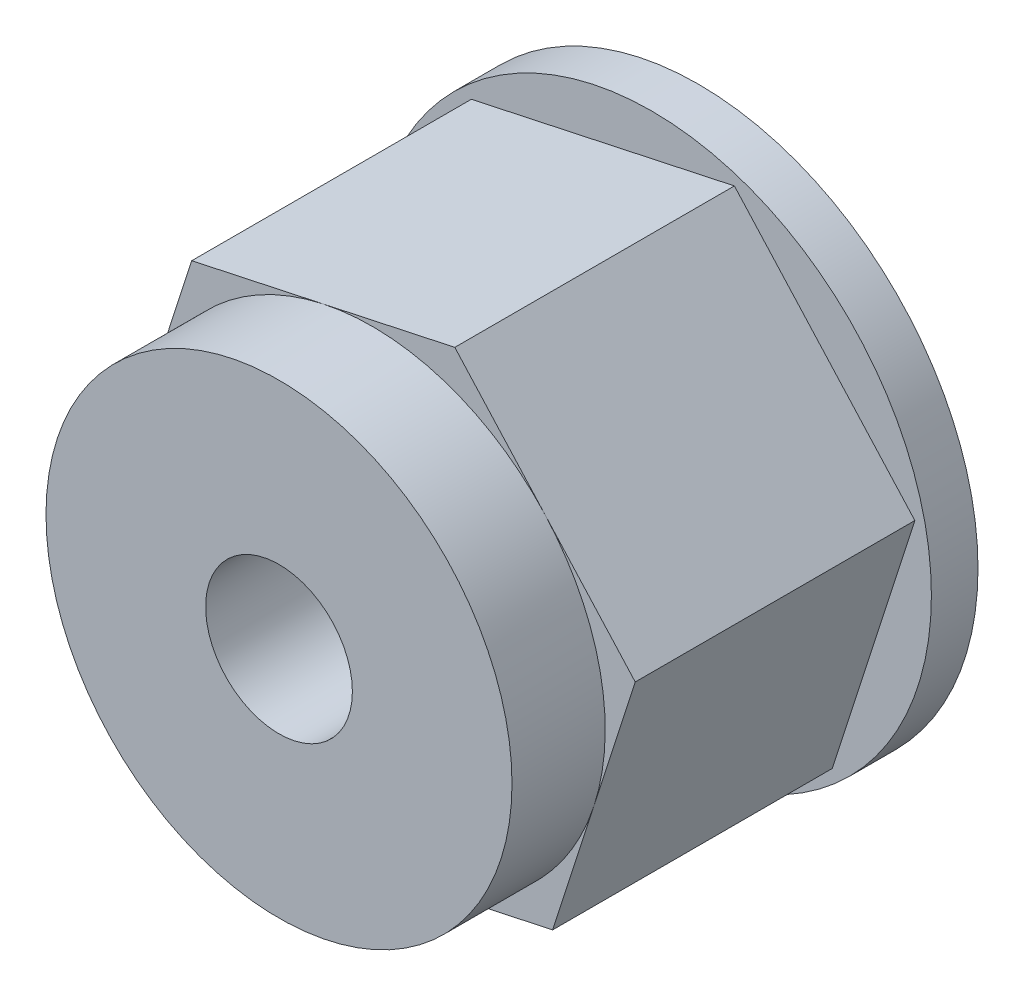
ISO-10303-21;
HEADER;
FILE_DESCRIPTION(('STEP AP214'),'2;1');
FILE_NAME('part.step','',(''),(''),'','','');
FILE_SCHEMA(('AUTOMOTIVE_DESIGN { 1 0 10303 214 1 1 1 1 }'));
ENDSEC;
DATA;
#1=APPLICATION_CONTEXT('core data for automotive mechanical design processes');
#2=APPLICATION_PROTOCOL_DEFINITION('international standard','automotive_design',2000,#1);
#3=PRODUCT_CONTEXT('',#1,'mechanical');
#4=PRODUCT('Part','Part','',(#3));
#5=PRODUCT_RELATED_PRODUCT_CATEGORY('part','',(#4));
#6=PRODUCT_DEFINITION_FORMATION('','',#4);
#7=PRODUCT_DEFINITION_CONTEXT('part definition',#1,'design');
#8=PRODUCT_DEFINITION('design','',#6,#7);
#9=PRODUCT_DEFINITION_SHAPE('','',#8);
#10=(LENGTH_UNIT() NAMED_UNIT(*) SI_UNIT(.MILLI.,.METRE.));
#11=(NAMED_UNIT(*) PLANE_ANGLE_UNIT() SI_UNIT($,.RADIAN.));
#12=(NAMED_UNIT(*) SI_UNIT($,.STERADIAN.) SOLID_ANGLE_UNIT());
#13=UNCERTAINTY_MEASURE_WITH_UNIT(LENGTH_MEASURE(1.E-05),#10,'distance_accuracy_value','');
#14=(GEOMETRIC_REPRESENTATION_CONTEXT(3) GLOBAL_UNCERTAINTY_ASSIGNED_CONTEXT((#13)) GLOBAL_UNIT_ASSIGNED_CONTEXT((#10,
#11,#12)) REPRESENTATION_CONTEXT('',''));
#15=CARTESIAN_POINT('',(0.,0.,0.));
#16=DIRECTION('',(0.,0.,1.));
#17=DIRECTION('',(1.,0.,0.));
#18=AXIS2_PLACEMENT_3D('',#15,#16,#17);
#19=CARTESIAN_POINT('',(0.,0.,8.89));
#20=DIRECTION('',(0.,0.,1.));
#21=DIRECTION('',(1.,0.,0.));
#22=AXIS2_PLACEMENT_3D('',#19,#20,#21);
#23=PLANE('',#22);
#24=CARTESIAN_POINT('',(0.,0.,8.89));
#25=DIRECTION('',(0.,0.,1.));
#26=DIRECTION('',(1.,0.,0.));
#27=AXIS2_PLACEMENT_3D('',#24,#25,#26);
#28=CIRCLE('',#27,6.35);
#29=CARTESIAN_POINT('',(4.71012279458396,4.25878424670006,8.89));
#30=VERTEX_POINT('',#29);
#31=CARTESIAN_POINT('',(-1.33315394958725,6.20847811840389,8.89));
#32=VERTEX_POINT('',#31);
#33=EDGE_CURVE('E43',#30,#32,#28,.T.);
#34=ORIENTED_EDGE('',*,*,#33,.F.);
#35=DIRECTION('',(-0.670674684519695,0.741751621194324,0.));
#36=VECTOR('',#35,1.);
#37=CARTESIAN_POINT('',(7.16893302583677,1.53939358333083,8.89));
#38=LINE('',#37,#36);
#39=CARTESIAN_POINT('',(2.25131256333114,6.9781749100693,8.89));
#40=VERTEX_POINT('',#39);
#41=EDGE_CURVE('E117',#30,#40,#38,.T.);
#42=ORIENTED_EDGE('',*,*,#41,.T.);
#43=DIRECTION('',(-0.977713089512424,-0.209945503872008,0.));
#44=VECTOR('',#43,1.);
#45=CARTESIAN_POINT('',(2.25131256333114,6.9781749100693,8.89));
#46=LINE('',#45,#44);
#47=EDGE_CURVE('E129',#40,#32,#46,.T.);
#48=ORIENTED_EDGE('',*,*,#47,.T.);
#49=EDGE_LOOP('',(#34,#42,#48));
#50=FACE_BOUND('',#49,.T.);
#51=ADVANCED_FACE('F32',(#50),#23,.T.);
#52=CARTESIAN_POINT('',(-6.04327674417121,1.94969387170383,8.89));
#53=VERTEX_POINT('',#52);
#54=EDGE_CURVE('E11',#32,#53,#28,.T.);
#55=ORIENTED_EDGE('',*,*,#54,.F.);
#56=CARTESIAN_POINT('',(-4.91762046250564,5.43878132673848,8.89));
#57=VERTEX_POINT('',#56);
#58=EDGE_CURVE('E116',#32,#57,#46,.T.);
#59=ORIENTED_EDGE('',*,*,#58,.T.);
#60=DIRECTION('',(-0.307038404992729,-0.951697125066332,0.));
#61=VECTOR('',#60,1.);
#62=CARTESIAN_POINT('',(-4.91762046250564,5.43878132673848,8.89));
#63=LINE('',#62,#61);
#64=EDGE_CURVE('E149',#57,#53,#63,.T.);
#65=ORIENTED_EDGE('',*,*,#64,.T.);
#66=EDGE_LOOP('',(#55,#59,#65));
#67=FACE_BOUND('',#66,.T.);
#68=ADVANCED_FACE('F201',(#67),#23,.T.);
#69=CARTESIAN_POINT('',(-4.71012279458396,-4.25878424670006,8.89));
#70=VERTEX_POINT('',#69);
#71=EDGE_CURVE('E41',#53,#70,#28,.T.);
#72=ORIENTED_EDGE('',*,*,#71,.F.);
#73=CARTESIAN_POINT('',(-7.16893302583678,-1.53939358333082,8.89));
#74=VERTEX_POINT('',#73);
#75=EDGE_CURVE('E148',#53,#74,#63,.T.);
#76=ORIENTED_EDGE('',*,*,#75,.T.);
#77=DIRECTION('',(0.670674684519695,-0.741751621194324,0.));
#78=VECTOR('',#77,1.);
#79=CARTESIAN_POINT('',(-7.16893302583678,-1.53939358333082,8.89));
#80=LINE('',#79,#78);
#81=EDGE_CURVE('E153',#74,#70,#80,.T.);
#82=ORIENTED_EDGE('',*,*,#81,.T.);
#83=EDGE_LOOP('',(#72,#76,#82));
#84=FACE_BOUND('',#83,.T.);
#85=ADVANCED_FACE('F206',(#84),#23,.T.);
#86=CARTESIAN_POINT('',(1.33315394958725,-6.20847811840389,8.89));
#87=VERTEX_POINT('',#86);
#88=EDGE_CURVE('E50',#70,#87,#28,.T.);
#89=ORIENTED_EDGE('',*,*,#88,.F.);
#90=CARTESIAN_POINT('',(-2.25131256333114,-6.9781749100693,8.89));
#91=VERTEX_POINT('',#90);
#92=EDGE_CURVE('E152',#70,#91,#80,.T.);
#93=ORIENTED_EDGE('',*,*,#92,.T.);
#94=DIRECTION('',(0.977713089512424,0.209945503872008,0.));
#95=VECTOR('',#94,1.);
#96=CARTESIAN_POINT('',(-2.25131256333114,-6.9781749100693,8.89));
#97=LINE('',#96,#95);
#98=EDGE_CURVE('E142',#91,#87,#97,.T.);
#99=ORIENTED_EDGE('',*,*,#98,.T.);
#100=EDGE_LOOP('',(#89,#93,#99));
#101=FACE_BOUND('',#100,.T.);
#102=ADVANCED_FACE('F222',(#101),#23,.T.);
#103=CARTESIAN_POINT('',(6.04327674417121,-1.94969387170383,8.89));
#104=VERTEX_POINT('',#103);
#105=EDGE_CURVE('E134',#87,#104,#28,.T.);
#106=ORIENTED_EDGE('',*,*,#105,.F.);
#107=CARTESIAN_POINT('',(4.91762046250564,-5.43878132673848,8.89));
#108=VERTEX_POINT('',#107);
#109=EDGE_CURVE('E144',#87,#108,#97,.T.);
#110=ORIENTED_EDGE('',*,*,#109,.T.);
#111=DIRECTION('',(0.307038404992728,0.951697125066332,0.));
#112=VECTOR('',#111,1.);
#113=CARTESIAN_POINT('',(4.91762046250564,-5.43878132673848,8.89));
#114=LINE('',#113,#112);
#115=EDGE_CURVE('E127',#108,#104,#114,.T.);
#116=ORIENTED_EDGE('',*,*,#115,.T.);
#117=EDGE_LOOP('',(#106,#110,#116));
#118=FACE_BOUND('',#117,.T.);
#119=ADVANCED_FACE('F212',(#118),#23,.T.);
#120=CARTESIAN_POINT('',(0.,0.,1.27));
#121=DIRECTION('',(0.,0.,1.));
#122=DIRECTION('',(1.,0.,0.));
#123=AXIS2_PLACEMENT_3D('',#120,#121,#122);
#124=PLANE('',#123);
#125=CARTESIAN_POINT('',(0.,0.,1.27));
#126=DIRECTION('',(0.,0.,1.));
#127=DIRECTION('',(1.,0.,0.));
#128=AXIS2_PLACEMENT_3D('',#125,#126,#127);
#129=CIRCLE('',#128,7.62);
#130=CARTESIAN_POINT('',(7.62,0.,1.27));
#131=VERTEX_POINT('',#130);
#132=EDGE_CURVE('E135',#131,#131,#129,.T.);
#133=ORIENTED_EDGE('',*,*,#132,.T.);
#134=EDGE_LOOP('',(#133));
#135=FACE_BOUND('',#134,.T.);
#136=DIRECTION('',(0.307038404992728,0.951697125066332,0.));
#137=VECTOR('',#136,1.);
#138=CARTESIAN_POINT('',(4.91762046250564,-5.43878132673848,1.27));
#139=LINE('',#138,#137);
#140=CARTESIAN_POINT('',(4.91762046250564,-5.43878132673848,1.27));
#141=VERTEX_POINT('',#140);
#142=CARTESIAN_POINT('',(7.16893302583677,1.53939358333083,1.27));
#143=VERTEX_POINT('',#142);
#144=EDGE_CURVE('E159',#141,#143,#139,.T.);
#145=ORIENTED_EDGE('',*,*,#144,.F.);
#146=DIRECTION('',(0.977713089512424,0.209945503872008,0.));
#147=VECTOR('',#146,1.);
#148=CARTESIAN_POINT('',(-2.25131256333114,-6.9781749100693,1.27));
#149=LINE('',#148,#147);
#150=CARTESIAN_POINT('',(-2.25131256333114,-6.9781749100693,1.27));
#151=VERTEX_POINT('',#150);
#152=EDGE_CURVE('E156',#151,#141,#149,.T.);
#153=ORIENTED_EDGE('',*,*,#152,.F.);
#154=DIRECTION('',(0.670674684519695,-0.741751621194324,0.));
#155=VECTOR('',#154,1.);
#156=CARTESIAN_POINT('',(-7.16893302583678,-1.53939358333082,1.27));
#157=LINE('',#156,#155);
#158=CARTESIAN_POINT('',(-7.16893302583677,-1.53939358333082,1.27));
#159=VERTEX_POINT('',#158);
#160=EDGE_CURVE('E168',#159,#151,#157,.T.);
#161=ORIENTED_EDGE('',*,*,#160,.F.);
#162=DIRECTION('',(-0.307038404992729,-0.951697125066332,0.));
#163=VECTOR('',#162,1.);
#164=CARTESIAN_POINT('',(-4.91762046250564,5.43878132673848,1.27));
#165=LINE('',#164,#163);
#166=CARTESIAN_POINT('',(-4.91762046250564,5.43878132673848,1.27));
#167=VERTEX_POINT('',#166);
#168=EDGE_CURVE('E165',#167,#159,#165,.T.);
#169=ORIENTED_EDGE('',*,*,#168,.F.);
#170=DIRECTION('',(-0.977713089512424,-0.209945503872008,0.));
#171=VECTOR('',#170,1.);
#172=CARTESIAN_POINT('',(2.25131256333114,6.9781749100693,1.27));
#173=LINE('',#172,#171);
#174=CARTESIAN_POINT('',(2.25131256333114,6.9781749100693,1.27));
#175=VERTEX_POINT('',#174);
#176=EDGE_CURVE('E163',#175,#167,#173,.T.);
#177=ORIENTED_EDGE('',*,*,#176,.F.);
#178=DIRECTION('',(-0.670674684519695,0.741751621194324,0.));
#179=VECTOR('',#178,1.);
#180=CARTESIAN_POINT('',(7.16893302583677,1.53939358333083,1.27));
#181=LINE('',#180,#179);
#182=EDGE_CURVE('E161',#143,#175,#181,.T.);
#183=ORIENTED_EDGE('',*,*,#182,.F.);
#184=EDGE_LOOP('',(#145,#153,#161,#169,#177,#183));
#185=FACE_BOUND('',#184,.T.);
#186=ADVANCED_FACE('F196',(#135,#185),#124,.T.);
#187=CARTESIAN_POINT('',(0.,0.,1.27));
#188=DIRECTION('',(0.,0.,-1.));
#189=DIRECTION('',(-1.,0.,0.));
#190=AXIS2_PLACEMENT_3D('',#187,#188,#189);
#191=CYLINDRICAL_SURFACE('',#190,7.62);
#192=ORIENTED_EDGE('',*,*,#132,.F.);
#193=EDGE_LOOP('',(#192));
#194=FACE_BOUND('',#193,.T.);
#195=CARTESIAN_POINT('',(0.,0.,0.));
#196=DIRECTION('',(0.,0.,1.));
#197=DIRECTION('',(1.,0.,0.));
#198=AXIS2_PLACEMENT_3D('',#195,#196,#197);
#199=CIRCLE('',#198,7.62);
#200=CARTESIAN_POINT('',(7.62,0.,0.));
#201=VERTEX_POINT('',#200);
#202=EDGE_CURVE('E137',#201,#201,#199,.T.);
#203=ORIENTED_EDGE('',*,*,#202,.T.);
#204=EDGE_LOOP('',(#203));
#205=FACE_BOUND('',#204,.T.);
#206=ADVANCED_FACE('F34',(#194,#205),#191,.T.);
#207=CARTESIAN_POINT('',(0.,0.,0.));
#208=DIRECTION('',(0.,0.,1.));
#209=DIRECTION('',(1.,0.,0.));
#210=AXIS2_PLACEMENT_3D('',#207,#208,#209);
#211=PLANE('',#210);
#212=CARTESIAN_POINT('',(0.,0.,0.));
#213=DIRECTION('',(0.,0.,1.));
#214=DIRECTION('',(1.,0.,0.));
#215=AXIS2_PLACEMENT_3D('',#212,#213,#214);
#216=CIRCLE('',#215,2.);
#217=CARTESIAN_POINT('',(2.,0.,0.));
#218=VERTEX_POINT('',#217);
#219=EDGE_CURVE('E313',#218,#218,#216,.T.);
#220=ORIENTED_EDGE('',*,*,#219,.T.);
#221=EDGE_LOOP('',(#220));
#222=FACE_BOUND('',#221,.T.);
#223=ORIENTED_EDGE('',*,*,#202,.F.);
#224=EDGE_LOOP('',(#223));
#225=FACE_BOUND('',#224,.T.);
#226=ADVANCED_FACE('F185',(#222,#225),#211,.F.);
#227=CARTESIAN_POINT('',(-2.25131256333114,-6.9781749100693,8.89));
#228=DIRECTION('',(-0.209945503872008,0.977713089512424,0.));
#229=DIRECTION('',(-0.977713089512424,-0.209945503872008,0.));
#230=AXIS2_PLACEMENT_3D('',#227,#228,#229);
#231=PLANE('',#230);
#232=ORIENTED_EDGE('',*,*,#152,.T.);
#233=DIRECTION('',(0.,0.,-1.));
#234=VECTOR('',#233,1.);
#235=CARTESIAN_POINT('',(4.91762046250564,-5.43878132673848,8.89));
#236=LINE('',#235,#234);
#237=EDGE_CURVE('E180',#108,#141,#236,.T.);
#238=ORIENTED_EDGE('',*,*,#237,.F.);
#239=ORIENTED_EDGE('',*,*,#109,.F.);
#240=ORIENTED_EDGE('',*,*,#98,.F.);
#241=DIRECTION('',(0.,0.,-1.));
#242=VECTOR('',#241,1.);
#243=CARTESIAN_POINT('',(-2.25131256333114,-6.9781749100693,8.89));
#244=LINE('',#243,#242);
#245=EDGE_CURVE('E155',#91,#151,#244,.T.);
#246=ORIENTED_EDGE('',*,*,#245,.T.);
#247=EDGE_LOOP('',(#232,#238,#239,#240,#246));
#248=FACE_BOUND('',#247,.T.);
#249=ADVANCED_FACE('F187',(#248),#231,.F.);
#250=CARTESIAN_POINT('',(4.91762046250564,-5.43878132673848,8.89));
#251=DIRECTION('',(-0.951697125066332,0.307038404992729,0.));
#252=DIRECTION('',(-0.307038404992729,-0.951697125066332,0.));
#253=AXIS2_PLACEMENT_3D('',#250,#251,#252);
#254=PLANE('',#253);
#255=ORIENTED_EDGE('',*,*,#144,.T.);
#256=DIRECTION('',(0.,0.,-1.));
#257=VECTOR('',#256,1.);
#258=CARTESIAN_POINT('',(7.16893302583677,1.53939358333083,8.89));
#259=LINE('',#258,#257);
#260=CARTESIAN_POINT('',(7.16893302583677,1.53939358333083,8.89));
#261=VERTEX_POINT('',#260);
#262=EDGE_CURVE('E178',#261,#143,#259,.T.);
#263=ORIENTED_EDGE('',*,*,#262,.F.);
#264=EDGE_CURVE('E112',#104,#261,#114,.T.);
#265=ORIENTED_EDGE('',*,*,#264,.F.);
#266=ORIENTED_EDGE('',*,*,#115,.F.);
#267=ORIENTED_EDGE('',*,*,#237,.T.);
#268=EDGE_LOOP('',(#255,#263,#265,#266,#267));
#269=FACE_BOUND('',#268,.T.);
#270=ADVANCED_FACE('F193',(#269),#254,.F.);
#271=CARTESIAN_POINT('',(7.16893302583677,1.53939358333083,8.89));
#272=DIRECTION('',(-0.741751621194324,-0.670674684519695,0.));
#273=DIRECTION('',(0.670674684519695,-0.741751621194324,0.));
#274=AXIS2_PLACEMENT_3D('',#271,#272,#273);
#275=PLANE('',#274);
#276=ORIENTED_EDGE('',*,*,#182,.T.);
#277=DIRECTION('',(0.,0.,-1.));
#278=VECTOR('',#277,1.);
#279=CARTESIAN_POINT('',(2.25131256333114,6.9781749100693,8.89));
#280=LINE('',#279,#278);
#281=EDGE_CURVE('E123',#40,#175,#280,.T.);
#282=ORIENTED_EDGE('',*,*,#281,.F.);
#283=ORIENTED_EDGE('',*,*,#41,.F.);
#284=EDGE_CURVE('E106',#261,#30,#38,.T.);
#285=ORIENTED_EDGE('',*,*,#284,.F.);
#286=ORIENTED_EDGE('',*,*,#262,.T.);
#287=EDGE_LOOP('',(#276,#282,#283,#285,#286));
#288=FACE_BOUND('',#287,.T.);
#289=ADVANCED_FACE('F121',(#288),#275,.F.);
#290=CARTESIAN_POINT('',(2.25131256333114,6.9781749100693,8.89));
#291=DIRECTION('',(0.209945503872008,-0.977713089512424,0.));
#292=DIRECTION('',(0.977713089512424,0.209945503872008,0.));
#293=AXIS2_PLACEMENT_3D('',#290,#291,#292);
#294=PLANE('',#293);
#295=ORIENTED_EDGE('',*,*,#176,.T.);
#296=DIRECTION('',(0.,0.,-1.));
#297=VECTOR('',#296,1.);
#298=CARTESIAN_POINT('',(-4.91762046250564,5.43878132673848,8.89));
#299=LINE('',#298,#297);
#300=EDGE_CURVE('E174',#57,#167,#299,.T.);
#301=ORIENTED_EDGE('',*,*,#300,.F.);
#302=ORIENTED_EDGE('',*,*,#58,.F.);
#303=ORIENTED_EDGE('',*,*,#47,.F.);
#304=ORIENTED_EDGE('',*,*,#281,.T.);
#305=EDGE_LOOP('',(#295,#301,#302,#303,#304));
#306=FACE_BOUND('',#305,.T.);
#307=ADVANCED_FACE('F238',(#306),#294,.F.);
#308=CARTESIAN_POINT('',(-4.91762046250564,5.43878132673848,8.89));
#309=DIRECTION('',(0.951697125066332,-0.307038404992729,0.));
#310=DIRECTION('',(0.307038404992729,0.951697125066332,0.));
#311=AXIS2_PLACEMENT_3D('',#308,#309,#310);
#312=PLANE('',#311);
#313=ORIENTED_EDGE('',*,*,#168,.T.);
#314=DIRECTION('',(0.,0.,-1.));
#315=VECTOR('',#314,1.);
#316=CARTESIAN_POINT('',(-7.16893302583678,-1.53939358333082,8.89));
#317=LINE('',#316,#315);
#318=EDGE_CURVE('E172',#74,#159,#317,.T.);
#319=ORIENTED_EDGE('',*,*,#318,.F.);
#320=ORIENTED_EDGE('',*,*,#75,.F.);
#321=ORIENTED_EDGE('',*,*,#64,.F.);
#322=ORIENTED_EDGE('',*,*,#300,.T.);
#323=EDGE_LOOP('',(#313,#319,#320,#321,#322));
#324=FACE_BOUND('',#323,.T.);
#325=ADVANCED_FACE('F219',(#324),#312,.F.);
#326=CARTESIAN_POINT('',(-7.16893302583678,-1.53939358333082,8.89));
#327=DIRECTION('',(0.741751621194324,0.670674684519695,0.));
#328=DIRECTION('',(-0.670674684519695,0.741751621194324,0.));
#329=AXIS2_PLACEMENT_3D('',#326,#327,#328);
#330=PLANE('',#329);
#331=ORIENTED_EDGE('',*,*,#160,.T.);
#332=ORIENTED_EDGE('',*,*,#245,.F.);
#333=ORIENTED_EDGE('',*,*,#92,.F.);
#334=ORIENTED_EDGE('',*,*,#81,.F.);
#335=ORIENTED_EDGE('',*,*,#318,.T.);
#336=EDGE_LOOP('',(#331,#332,#333,#334,#335));
#337=FACE_BOUND('',#336,.T.);
#338=ADVANCED_FACE('F211',(#337),#330,.F.);
#339=EDGE_CURVE('E110',#104,#30,#28,.T.);
#340=ORIENTED_EDGE('',*,*,#339,.F.);
#341=ORIENTED_EDGE('',*,*,#264,.T.);
#342=ORIENTED_EDGE('',*,*,#284,.T.);
#343=EDGE_LOOP('',(#340,#341,#342));
#344=FACE_BOUND('',#343,.T.);
#345=ADVANCED_FACE('F108',(#344),#23,.T.);
#346=CARTESIAN_POINT('',(0.,0.,11.43));
#347=DIRECTION('',(0.,0.,-1.));
#348=DIRECTION('',(-1.,0.,0.));
#349=AXIS2_PLACEMENT_3D('',#346,#347,#348);
#350=CYLINDRICAL_SURFACE('',#349,6.35);
#351=CARTESIAN_POINT('',(0.,0.,11.43));
#352=DIRECTION('',(0.,0.,1.));
#353=DIRECTION('',(1.,0.,0.));
#354=AXIS2_PLACEMENT_3D('',#351,#352,#353);
#355=CIRCLE('',#354,6.35);
#356=CARTESIAN_POINT('',(6.35,0.,11.43));
#357=VERTEX_POINT('',#356);
#358=EDGE_CURVE('E131',#357,#357,#355,.T.);
#359=ORIENTED_EDGE('',*,*,#358,.F.);
#360=EDGE_LOOP('',(#359));
#361=FACE_BOUND('',#360,.T.);
#362=ORIENTED_EDGE('',*,*,#33,.T.);
#363=ORIENTED_EDGE('',*,*,#54,.T.);
#364=ORIENTED_EDGE('',*,*,#71,.T.);
#365=ORIENTED_EDGE('',*,*,#88,.T.);
#366=ORIENTED_EDGE('',*,*,#105,.T.);
#367=ORIENTED_EDGE('',*,*,#339,.T.);
#368=EDGE_LOOP('',(#362,#363,#364,#365,#366,#367));
#369=FACE_BOUND('',#368,.T.);
#370=ADVANCED_FACE('F133',(#361,#369),#350,.T.);
#371=CARTESIAN_POINT('',(0.,0.,11.43));
#372=DIRECTION('',(0.,0.,1.));
#373=DIRECTION('',(1.,0.,0.));
#374=AXIS2_PLACEMENT_3D('',#371,#372,#373);
#375=PLANE('',#374);
#376=CARTESIAN_POINT('',(0.,0.,11.43));
#377=DIRECTION('',(0.,0.,1.));
#378=DIRECTION('',(1.,0.,0.));
#379=AXIS2_PLACEMENT_3D('',#376,#377,#378);
#380=CIRCLE('',#379,2.);
#381=CARTESIAN_POINT('',(2.,0.,11.43));
#382=VERTEX_POINT('',#381);
#383=EDGE_CURVE('E36',#382,#382,#380,.T.);
#384=ORIENTED_EDGE('',*,*,#383,.F.);
#385=EDGE_LOOP('',(#384));
#386=FACE_BOUND('',#385,.T.);
#387=ORIENTED_EDGE('',*,*,#358,.T.);
#388=EDGE_LOOP('',(#387));
#389=FACE_BOUND('',#388,.T.);
#390=ADVANCED_FACE('F217',(#386,#389),#375,.T.);
#391=CARTESIAN_POINT('',(0.,0.,0.));
#392=DIRECTION('',(0.,0.,1.));
#393=DIRECTION('',(1.,0.,0.));
#394=AXIS2_PLACEMENT_3D('',#391,#392,#393);
#395=CYLINDRICAL_SURFACE('',#394,2.);
#396=ORIENTED_EDGE('',*,*,#383,.T.);
#397=EDGE_LOOP('',(#396));
#398=FACE_BOUND('',#397,.T.);
#399=ORIENTED_EDGE('',*,*,#219,.F.);
#400=EDGE_LOOP('',(#399));
#401=FACE_BOUND('',#400,.T.);
#402=ADVANCED_FACE('F295',(#398,#401),#395,.F.);
#403=CLOSED_SHELL('',(#51,#68,#85,#102,#119,#186,#206,#226,#249,#270,#289,#307,#325,#338,#345,
#370,#390,#402));
#404=MANIFOLD_SOLID_BREP('B2',#403);
#405=ADVANCED_BREP_SHAPE_REPRESENTATION('',(#18,#404),#14);
#406=SHAPE_DEFINITION_REPRESENTATION(#9,#405);
ENDSEC;
END-ISO-10303-21;
